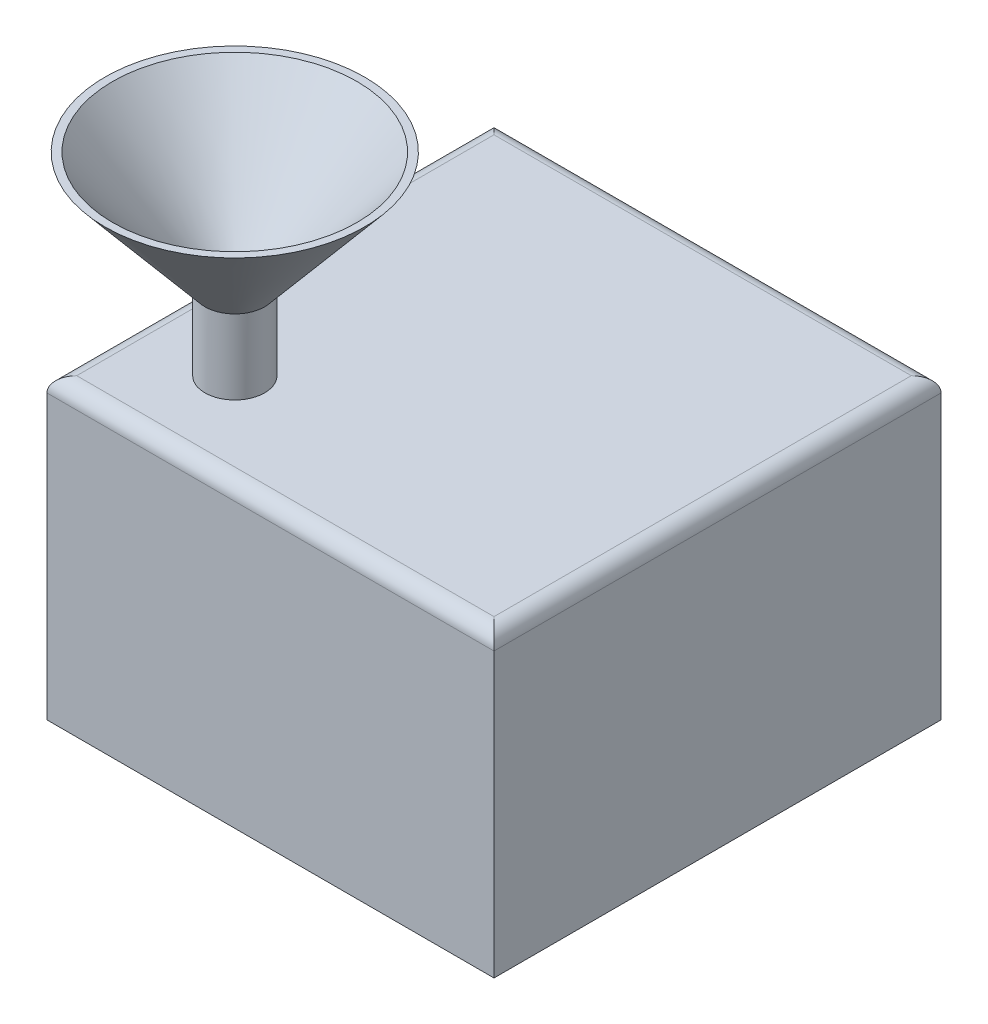
ISO-10303-21;
HEADER;
FILE_DESCRIPTION(('STEP AP214'),'2;1');
FILE_NAME('part.step','',(''),(''),'','','');
FILE_SCHEMA(('AUTOMOTIVE_DESIGN { 1 0 10303 214 1 1 1 1 }'));
ENDSEC;
DATA;
#1=APPLICATION_CONTEXT('core data for automotive mechanical design processes');
#2=APPLICATION_PROTOCOL_DEFINITION('international standard','automotive_design',2000,#1);
#3=PRODUCT_CONTEXT('',#1,'mechanical');
#4=PRODUCT('Part','Part','',(#3));
#5=PRODUCT_RELATED_PRODUCT_CATEGORY('part','',(#4));
#6=PRODUCT_DEFINITION_FORMATION('','',#4);
#7=PRODUCT_DEFINITION_CONTEXT('part definition',#1,'design');
#8=PRODUCT_DEFINITION('design','',#6,#7);
#9=PRODUCT_DEFINITION_SHAPE('','',#8);
#10=(LENGTH_UNIT() NAMED_UNIT(*) SI_UNIT(.MILLI.,.METRE.));
#11=(NAMED_UNIT(*) PLANE_ANGLE_UNIT() SI_UNIT($,.RADIAN.));
#12=(NAMED_UNIT(*) SI_UNIT($,.STERADIAN.) SOLID_ANGLE_UNIT());
#13=UNCERTAINTY_MEASURE_WITH_UNIT(LENGTH_MEASURE(1.E-05),#10,'distance_accuracy_value','');
#14=(GEOMETRIC_REPRESENTATION_CONTEXT(3) GLOBAL_UNCERTAINTY_ASSIGNED_CONTEXT((#13)) GLOBAL_UNIT_ASSIGNED_CONTEXT((#10,
#11,#12)) REPRESENTATION_CONTEXT('',''));
#15=CARTESIAN_POINT('',(0.,0.,0.));
#16=DIRECTION('',(0.,0.,1.));
#17=DIRECTION('',(1.,0.,0.));
#18=AXIS2_PLACEMENT_3D('',#15,#16,#17);
#19=CARTESIAN_POINT('',(0.,200.,0.));
#20=DIRECTION('',(0.,-1.,0.));
#21=DIRECTION('',(0.,0.,-1.));
#22=AXIS2_PLACEMENT_3D('',#19,#20,#21);
#23=PLANE('',#22);
#24=CARTESIAN_POINT('',(-86.966991411009,200.,86.966991411009));
#25=DIRECTION('',(0.,1.,0.));
#26=DIRECTION('',(0.,0.,1.));
#27=AXIS2_PLACEMENT_3D('',#24,#25,#26);
#28=CIRCLE('',#27,15.);
#29=CARTESIAN_POINT('',(-86.966991411009,200.,101.966991411009));
#30=VERTEX_POINT('',#29);
#31=EDGE_CURVE('E97',#30,#30,#28,.T.);
#32=ORIENTED_EDGE('',*,*,#31,.T.);
#33=EDGE_LOOP('',(#32));
#34=FACE_BOUND('',#33,.T.);
#35=ADVANCED_FACE('F17',(#34),#23,.F.);
#36=CARTESIAN_POINT('',(-86.966991411009,250.,86.966991411009));
#37=DIRECTION('',(0.,-1.,0.));
#38=DIRECTION('',(0.,0.,-1.));
#39=AXIS2_PLACEMENT_3D('',#36,#37,#38);
#40=CYLINDRICAL_SURFACE('',#39,15.);
#41=CARTESIAN_POINT('',(-86.966991411009,250.,86.966991411009));
#42=DIRECTION('',(0.,1.,0.));
#43=DIRECTION('',(0.,0.,1.));
#44=AXIS2_PLACEMENT_3D('',#41,#42,#43);
#45=CIRCLE('',#44,15.);
#46=CARTESIAN_POINT('',(-86.966991411009,250.,101.966991411009));
#47=VERTEX_POINT('',#46);
#48=EDGE_CURVE('E220',#47,#47,#45,.T.);
#49=ORIENTED_EDGE('',*,*,#48,.T.);
#50=EDGE_LOOP('',(#49));
#51=FACE_BOUND('',#50,.T.);
#52=ORIENTED_EDGE('',*,*,#31,.F.);
#53=EDGE_LOOP('',(#52));
#54=FACE_BOUND('',#53,.T.);
#55=ADVANCED_FACE('F157',(#51,#54),#40,.F.);
#56=CARTESIAN_POINT('',(-86.966991411009,250.,86.966991411009));
#57=DIRECTION('',(0.,1.,0.));
#58=DIRECTION('',(0.,0.,1.));
#59=AXIS2_PLACEMENT_3D('',#56,#57,#58);
#60=PLANE('',#59);
#61=CARTESIAN_POINT('',(-86.966991411009,250.,86.966991411009));
#62=DIRECTION('',(0.,1.,0.));
#63=DIRECTION('',(0.,0.,1.));
#64=AXIS2_PLACEMENT_3D('',#61,#62,#63);
#65=CIRCLE('',#64,14.8720295058174);
#66=CARTESIAN_POINT('',(-86.966991411009,250.,101.839020916826));
#67=VERTEX_POINT('',#66);
#68=EDGE_CURVE('E210',#67,#67,#65,.T.);
#69=ORIENTED_EDGE('',*,*,#68,.T.);
#70=EDGE_LOOP('',(#69));
#71=FACE_BOUND('',#70,.T.);
#72=ORIENTED_EDGE('',*,*,#48,.F.);
#73=EDGE_LOOP('',(#72));
#74=FACE_BOUND('',#73,.T.);
#75=ADVANCED_FACE('F164',(#71,#74),#60,.F.);
#76=CARTESIAN_POINT('',(-86.966991411009,330.,86.966991411009));
#77=DIRECTION('',(0.,1.,0.));
#78=DIRECTION('',(0.,0.,1.));
#79=AXIS2_PLACEMENT_3D('',#76,#77,#78);
#80=CONICAL_SURFACE('',#79,82.,0.698131700797734);
#81=ORIENTED_EDGE('',*,*,#68,.F.);
#82=EDGE_LOOP('',(#81));
#83=FACE_BOUND('',#82,.T.);
#84=CARTESIAN_POINT('',(-86.966991411009,330.,86.966991411009));
#85=DIRECTION('',(0.,1.,0.));
#86=DIRECTION('',(0.,0.,1.));
#87=AXIS2_PLACEMENT_3D('',#84,#85,#86);
#88=CIRCLE('',#87,82.);
#89=CARTESIAN_POINT('',(-86.966991411009,330.,168.966991411009));
#90=VERTEX_POINT('',#89);
#91=EDGE_CURVE('E213',#90,#90,#88,.T.);
#92=ORIENTED_EDGE('',*,*,#91,.T.);
#93=EDGE_LOOP('',(#92));
#94=FACE_BOUND('',#93,.T.);
#95=ADVANCED_FACE('F195',(#83,#94),#80,.F.);
#96=CARTESIAN_POINT('',(150.,200.,150.));
#97=DIRECTION('',(-1.,0.,0.));
#98=DIRECTION('',(0.,0.,1.));
#99=AXIS2_PLACEMENT_3D('',#96,#97,#98);
#100=PLANE('',#99);
#101=DIRECTION('',(0.,-1.,0.));
#102=VECTOR('',#101,1.);
#103=CARTESIAN_POINT('',(150.,200.,-150.));
#104=LINE('',#103,#102);
#105=CARTESIAN_POINT('',(150.,190.,-150.));
#106=VERTEX_POINT('',#105);
#107=CARTESIAN_POINT('',(150.,0.,-150.));
#108=VERTEX_POINT('',#107);
#109=EDGE_CURVE('E69',#106,#108,#104,.T.);
#110=ORIENTED_EDGE('',*,*,#109,.F.);
#111=DIRECTION('',(0.,0.,-1.));
#112=VECTOR('',#111,1.);
#113=CARTESIAN_POINT('',(150.,190.,150.));
#114=LINE('',#113,#112);
#115=CARTESIAN_POINT('',(150.,190.,150.));
#116=VERTEX_POINT('',#115);
#117=EDGE_CURVE('E25',#106,#116,#114,.F.);
#118=ORIENTED_EDGE('',*,*,#117,.T.);
#119=DIRECTION('',(0.,-1.,0.));
#120=VECTOR('',#119,1.);
#121=CARTESIAN_POINT('',(150.,200.,150.));
#122=LINE('',#121,#120);
#123=CARTESIAN_POINT('',(150.,0.,150.));
#124=VERTEX_POINT('',#123);
#125=EDGE_CURVE('E90',#116,#124,#122,.T.);
#126=ORIENTED_EDGE('',*,*,#125,.T.);
#127=DIRECTION('',(0.,0.,-1.));
#128=VECTOR('',#127,1.);
#129=CARTESIAN_POINT('',(150.,0.,150.));
#130=LINE('',#129,#128);
#131=EDGE_CURVE('E84',#124,#108,#130,.T.);
#132=ORIENTED_EDGE('',*,*,#131,.T.);
#133=EDGE_LOOP('',(#110,#118,#126,#132));
#134=FACE_BOUND('',#133,.T.);
#135=ADVANCED_FACE('F88',(#134),#100,.F.);
#136=CARTESIAN_POINT('',(-150.,200.,-150.));
#137=DIRECTION('',(0.,0.,1.));
#138=DIRECTION('',(1.,0.,0.));
#139=AXIS2_PLACEMENT_3D('',#136,#137,#138);
#140=PLANE('',#139);
#141=DIRECTION('',(0.,-1.,0.));
#142=VECTOR('',#141,1.);
#143=CARTESIAN_POINT('',(-150.,200.,-150.));
#144=LINE('',#143,#142);
#145=CARTESIAN_POINT('',(-150.,190.,-150.));
#146=VERTEX_POINT('',#145);
#147=CARTESIAN_POINT('',(-150.,0.,-150.));
#148=VERTEX_POINT('',#147);
#149=EDGE_CURVE('E78',#146,#148,#144,.T.);
#150=ORIENTED_EDGE('',*,*,#149,.F.);
#151=DIRECTION('',(-1.,0.,0.));
#152=VECTOR('',#151,1.);
#153=CARTESIAN_POINT('',(-150.,190.,-150.));
#154=LINE('',#153,#152);
#155=EDGE_CURVE('E32',#146,#106,#154,.F.);
#156=ORIENTED_EDGE('',*,*,#155,.T.);
#157=ORIENTED_EDGE('',*,*,#109,.T.);
#158=DIRECTION('',(-1.,0.,0.));
#159=VECTOR('',#158,1.);
#160=CARTESIAN_POINT('',(-150.,0.,-150.));
#161=LINE('',#160,#159);
#162=EDGE_CURVE('E72',#108,#148,#161,.T.);
#163=ORIENTED_EDGE('',*,*,#162,.T.);
#164=EDGE_LOOP('',(#150,#156,#157,#163));
#165=FACE_BOUND('',#164,.T.);
#166=ADVANCED_FACE('F71',(#165),#140,.F.);
#167=CARTESIAN_POINT('',(-150.,200.,150.));
#168=DIRECTION('',(1.,0.,0.));
#169=DIRECTION('',(0.,0.,-1.));
#170=AXIS2_PLACEMENT_3D('',#167,#168,#169);
#171=PLANE('',#170);
#172=DIRECTION('',(0.,-1.,0.));
#173=VECTOR('',#172,1.);
#174=CARTESIAN_POINT('',(-150.,200.,150.));
#175=LINE('',#174,#173);
#176=CARTESIAN_POINT('',(-150.,190.,150.));
#177=VERTEX_POINT('',#176);
#178=CARTESIAN_POINT('',(-150.,0.,150.));
#179=VERTEX_POINT('',#178);
#180=EDGE_CURVE('E104',#177,#179,#175,.T.);
#181=ORIENTED_EDGE('',*,*,#180,.F.);
#182=DIRECTION('',(0.,0.,1.));
#183=VECTOR('',#182,1.);
#184=CARTESIAN_POINT('',(-150.,190.,150.));
#185=LINE('',#184,#183);
#186=EDGE_CURVE('E40',#177,#146,#185,.F.);
#187=ORIENTED_EDGE('',*,*,#186,.T.);
#188=ORIENTED_EDGE('',*,*,#149,.T.);
#189=DIRECTION('',(0.,0.,1.));
#190=VECTOR('',#189,1.);
#191=CARTESIAN_POINT('',(-150.,0.,150.));
#192=LINE('',#191,#190);
#193=EDGE_CURVE('E86',#148,#179,#192,.T.);
#194=ORIENTED_EDGE('',*,*,#193,.T.);
#195=EDGE_LOOP('',(#181,#187,#188,#194));
#196=FACE_BOUND('',#195,.T.);
#197=ADVANCED_FACE('F145',(#196),#171,.F.);
#198=CARTESIAN_POINT('',(-150.,200.,150.));
#199=DIRECTION('',(0.,0.,-1.));
#200=DIRECTION('',(-1.,0.,0.));
#201=AXIS2_PLACEMENT_3D('',#198,#199,#200);
#202=PLANE('',#201);
#203=ORIENTED_EDGE('',*,*,#125,.F.);
#204=DIRECTION('',(1.,0.,0.));
#205=VECTOR('',#204,1.);
#206=CARTESIAN_POINT('',(-150.,190.,150.));
#207=LINE('',#206,#205);
#208=EDGE_CURVE('E115',#116,#177,#207,.F.);
#209=ORIENTED_EDGE('',*,*,#208,.T.);
#210=ORIENTED_EDGE('',*,*,#180,.T.);
#211=DIRECTION('',(1.,0.,0.));
#212=VECTOR('',#211,1.);
#213=CARTESIAN_POINT('',(-150.,0.,150.));
#214=LINE('',#213,#212);
#215=EDGE_CURVE('E101',#179,#124,#214,.T.);
#216=ORIENTED_EDGE('',*,*,#215,.T.);
#217=EDGE_LOOP('',(#203,#209,#210,#216));
#218=FACE_BOUND('',#217,.T.);
#219=ADVANCED_FACE('F144',(#218),#202,.F.);
#220=CARTESIAN_POINT('',(-86.966991411009,200.,86.966991411009));
#221=DIRECTION('',(0.,-1.,0.));
#222=DIRECTION('',(0.,0.,-1.));
#223=AXIS2_PLACEMENT_3D('',#220,#221,#222);
#224=CIRCLE('',#223,20.);
#225=CARTESIAN_POINT('',(-86.966991411009,200.,66.966991411009));
#226=VERTEX_POINT('',#225);
#227=EDGE_CURVE('E11',#226,#226,#224,.F.);
#228=ORIENTED_EDGE('',*,*,#227,.F.);
#229=EDGE_LOOP('',(#228));
#230=FACE_BOUND('',#229,.T.);
#231=DIRECTION('',(0.,0.,1.));
#232=VECTOR('',#231,1.);
#233=CARTESIAN_POINT('',(-140.,200.,0.));
#234=LINE('',#233,#232);
#235=CARTESIAN_POINT('',(-140.,200.,-140.));
#236=VERTEX_POINT('',#235);
#237=CARTESIAN_POINT('',(-140.,200.,140.));
#238=VERTEX_POINT('',#237);
#239=EDGE_CURVE('E110',#236,#238,#234,.T.);
#240=ORIENTED_EDGE('',*,*,#239,.T.);
#241=DIRECTION('',(1.,0.,0.));
#242=VECTOR('',#241,1.);
#243=CARTESIAN_POINT('',(0.,200.,140.));
#244=LINE('',#243,#242);
#245=CARTESIAN_POINT('',(140.,200.,140.));
#246=VERTEX_POINT('',#245);
#247=EDGE_CURVE('E112',#238,#246,#244,.T.);
#248=ORIENTED_EDGE('',*,*,#247,.T.);
#249=DIRECTION('',(0.,0.,-1.));
#250=VECTOR('',#249,1.);
#251=CARTESIAN_POINT('',(140.,200.,0.));
#252=LINE('',#251,#250);
#253=CARTESIAN_POINT('',(140.,200.,-140.));
#254=VERTEX_POINT('',#253);
#255=EDGE_CURVE('E77',#246,#254,#252,.T.);
#256=ORIENTED_EDGE('',*,*,#255,.T.);
#257=DIRECTION('',(-1.,0.,0.));
#258=VECTOR('',#257,1.);
#259=CARTESIAN_POINT('',(0.,200.,-140.));
#260=LINE('',#259,#258);
#261=EDGE_CURVE('E108',#254,#236,#260,.T.);
#262=ORIENTED_EDGE('',*,*,#261,.T.);
#263=EDGE_LOOP('',(#240,#248,#256,#262));
#264=FACE_BOUND('',#263,.T.);
#265=ADVANCED_FACE('F137',(#230,#264),#23,.F.);
#266=CARTESIAN_POINT('',(0.,0.,0.));
#267=DIRECTION('',(0.,-1.,0.));
#268=DIRECTION('',(0.,0.,-1.));
#269=AXIS2_PLACEMENT_3D('',#266,#267,#268);
#270=PLANE('',#269);
#271=ORIENTED_EDGE('',*,*,#131,.F.);
#272=ORIENTED_EDGE('',*,*,#215,.F.);
#273=ORIENTED_EDGE('',*,*,#193,.F.);
#274=ORIENTED_EDGE('',*,*,#162,.F.);
#275=EDGE_LOOP('',(#271,#272,#273,#274));
#276=FACE_BOUND('',#275,.T.);
#277=ADVANCED_FACE('F82',(#276),#270,.T.);
#278=CARTESIAN_POINT('',(0.,190.,-140.));
#279=DIRECTION('',(-1.,0.,0.));
#280=DIRECTION('',(0.,0.,1.));
#281=AXIS2_PLACEMENT_3D('',#278,#279,#280);
#282=CYLINDRICAL_SURFACE('',#281,10.);
#283=CARTESIAN_POINT('',(140.,190.,-140.));
#284=DIRECTION('',(-0.707106781186548,0.,-0.707106781186548));
#285=DIRECTION('',(0.707106781186548,0.,-0.707106781186548));
#286=AXIS2_PLACEMENT_3D('',#283,#284,#285);
#287=ELLIPSE('',#286,14.1421356237309,10.);
#288=EDGE_CURVE('E95',#106,#254,#287,.F.);
#289=ORIENTED_EDGE('',*,*,#288,.F.);
#290=ORIENTED_EDGE('',*,*,#155,.F.);
#291=CARTESIAN_POINT('',(-140.,190.,-140.));
#292=DIRECTION('',(-0.707106781186548,0.,0.707106781186548));
#293=DIRECTION('',(-0.707106781186548,0.,-0.707106781186548));
#294=AXIS2_PLACEMENT_3D('',#291,#292,#293);
#295=ELLIPSE('',#294,14.1421356237309,10.);
#296=EDGE_CURVE('E92',#236,#146,#295,.T.);
#297=ORIENTED_EDGE('',*,*,#296,.F.);
#298=ORIENTED_EDGE('',*,*,#261,.F.);
#299=EDGE_LOOP('',(#289,#290,#297,#298));
#300=FACE_BOUND('',#299,.T.);
#301=ADVANCED_FACE('F19',(#300),#282,.T.);
#302=CARTESIAN_POINT('',(-140.,190.,0.));
#303=DIRECTION('',(0.,0.,1.));
#304=DIRECTION('',(1.,0.,0.));
#305=AXIS2_PLACEMENT_3D('',#302,#303,#304);
#306=CYLINDRICAL_SURFACE('',#305,10.);
#307=ORIENTED_EDGE('',*,*,#296,.T.);
#308=ORIENTED_EDGE('',*,*,#186,.F.);
#309=CARTESIAN_POINT('',(-140.,190.,140.));
#310=DIRECTION('',(0.707106781186548,0.,0.707106781186548));
#311=DIRECTION('',(-0.707106781186548,0.,0.707106781186548));
#312=AXIS2_PLACEMENT_3D('',#309,#310,#311);
#313=ELLIPSE('',#312,14.1421356237309,10.);
#314=EDGE_CURVE('E123',#238,#177,#313,.T.);
#315=ORIENTED_EDGE('',*,*,#314,.F.);
#316=ORIENTED_EDGE('',*,*,#239,.F.);
#317=EDGE_LOOP('',(#307,#308,#315,#316));
#318=FACE_BOUND('',#317,.T.);
#319=ADVANCED_FACE('F235',(#318),#306,.T.);
#320=CARTESIAN_POINT('',(140.,190.,0.));
#321=DIRECTION('',(0.,0.,-1.));
#322=DIRECTION('',(-1.,0.,0.));
#323=AXIS2_PLACEMENT_3D('',#320,#321,#322);
#324=CYLINDRICAL_SURFACE('',#323,10.);
#325=ORIENTED_EDGE('',*,*,#288,.T.);
#326=ORIENTED_EDGE('',*,*,#255,.F.);
#327=CARTESIAN_POINT('',(140.,190.,140.));
#328=DIRECTION('',(0.707106781186548,0.,-0.707106781186548));
#329=DIRECTION('',(-0.707106781186548,0.,-0.707106781186548));
#330=AXIS2_PLACEMENT_3D('',#327,#328,#329);
#331=ELLIPSE('',#330,14.1421356237309,10.);
#332=EDGE_CURVE('E121',#116,#246,#331,.F.);
#333=ORIENTED_EDGE('',*,*,#332,.F.);
#334=ORIENTED_EDGE('',*,*,#117,.F.);
#335=EDGE_LOOP('',(#325,#326,#333,#334));
#336=FACE_BOUND('',#335,.T.);
#337=ADVANCED_FACE('F130',(#336),#324,.T.);
#338=CARTESIAN_POINT('',(0.,190.,140.));
#339=DIRECTION('',(1.,0.,0.));
#340=DIRECTION('',(0.,0.,-1.));
#341=AXIS2_PLACEMENT_3D('',#338,#339,#340);
#342=CYLINDRICAL_SURFACE('',#341,10.);
#343=ORIENTED_EDGE('',*,*,#314,.T.);
#344=ORIENTED_EDGE('',*,*,#208,.F.);
#345=ORIENTED_EDGE('',*,*,#332,.T.);
#346=ORIENTED_EDGE('',*,*,#247,.F.);
#347=EDGE_LOOP('',(#343,#344,#345,#346));
#348=FACE_BOUND('',#347,.T.);
#349=ADVANCED_FACE('F141',(#348),#342,.T.);
#350=CARTESIAN_POINT('',(-86.966991411009,250.,86.966991411009));
#351=DIRECTION('',(0.,-1.,0.));
#352=DIRECTION('',(0.,0.,-1.));
#353=AXIS2_PLACEMENT_3D('',#350,#351,#352);
#354=CYLINDRICAL_SURFACE('',#353,20.);
#355=CARTESIAN_POINT('',(-86.966991411009,250.,86.966991411009));
#356=DIRECTION('',(0.,1.,0.));
#357=DIRECTION('',(0.,0.,1.));
#358=AXIS2_PLACEMENT_3D('',#355,#356,#357);
#359=CIRCLE('',#358,20.);
#360=CARTESIAN_POINT('',(-86.966991411009,250.,106.966991411009));
#361=VERTEX_POINT('',#360);
#362=EDGE_CURVE('E124',#361,#361,#359,.T.);
#363=ORIENTED_EDGE('',*,*,#362,.F.);
#364=EDGE_LOOP('',(#363));
#365=FACE_BOUND('',#364,.T.);
#366=ORIENTED_EDGE('',*,*,#227,.T.);
#367=EDGE_LOOP('',(#366));
#368=FACE_BOUND('',#367,.T.);
#369=ADVANCED_FACE('F177',(#365,#368),#354,.T.);
#370=CARTESIAN_POINT('',(-86.966991411009,250.,86.966991411009));
#371=DIRECTION('',(0.,1.,0.));
#372=DIRECTION('',(0.,0.,1.));
#373=AXIS2_PLACEMENT_3D('',#370,#371,#372);
#374=CONICAL_SURFACE('',#373,20.,0.698131700797734);
#375=CARTESIAN_POINT('',(-86.966991411009,330.,86.966991411009));
#376=DIRECTION('',(0.,1.,0.));
#377=DIRECTION('',(0.,0.,1.));
#378=AXIS2_PLACEMENT_3D('',#375,#376,#377);
#379=CIRCLE('',#378,87.1279704941826);
#380=CARTESIAN_POINT('',(-86.966991411009,330.,174.094961905192));
#381=VERTEX_POINT('',#380);
#382=EDGE_CURVE('E215',#381,#381,#379,.T.);
#383=ORIENTED_EDGE('',*,*,#382,.F.);
#384=EDGE_LOOP('',(#383));
#385=FACE_BOUND('',#384,.T.);
#386=ORIENTED_EDGE('',*,*,#362,.T.);
#387=EDGE_LOOP('',(#386));
#388=FACE_BOUND('',#387,.T.);
#389=ADVANCED_FACE('F179',(#385,#388),#374,.T.);
#390=CARTESIAN_POINT('',(-86.966991411009,330.,86.966991411009));
#391=DIRECTION('',(0.,1.,0.));
#392=DIRECTION('',(0.,0.,1.));
#393=AXIS2_PLACEMENT_3D('',#390,#391,#392);
#394=PLANE('',#393);
#395=ORIENTED_EDGE('',*,*,#91,.F.);
#396=EDGE_LOOP('',(#395));
#397=FACE_BOUND('',#396,.T.);
#398=ORIENTED_EDGE('',*,*,#382,.T.);
#399=EDGE_LOOP('',(#398));
#400=FACE_BOUND('',#399,.T.);
#401=ADVANCED_FACE('F187',(#397,#400),#394,.T.);
#402=CLOSED_SHELL('',(#35,#55,#75,#95,#135,#166,#197,#219,#265,#277,#301,#319,#337,#349,#369,
#389,#401));
#403=MANIFOLD_SOLID_BREP('B1',#402);
#404=ADVANCED_BREP_SHAPE_REPRESENTATION('',(#18,#403),#14);
#405=SHAPE_DEFINITION_REPRESENTATION(#9,#404);
ENDSEC;
END-ISO-10303-21;
